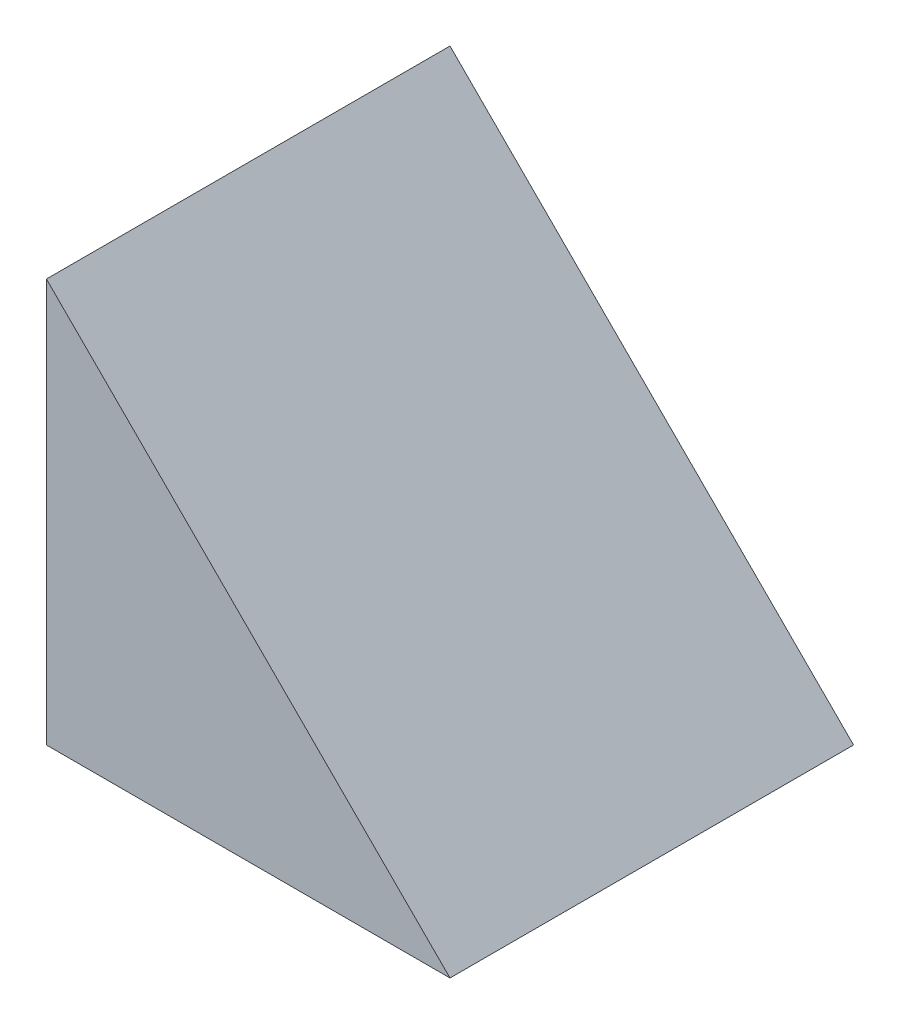
ISO-10303-21;
HEADER;
FILE_DESCRIPTION(('STEP AP214'),'2;1');
FILE_NAME('part.step','',(''),(''),'','','');
FILE_SCHEMA(('AUTOMOTIVE_DESIGN { 1 0 10303 214 1 1 1 1 }'));
ENDSEC;
DATA;
#1=APPLICATION_CONTEXT('core data for automotive mechanical design processes');
#2=APPLICATION_PROTOCOL_DEFINITION('international standard','automotive_design',2000,#1);
#3=PRODUCT_CONTEXT('',#1,'mechanical');
#4=PRODUCT('Part','Part','',(#3));
#5=PRODUCT_RELATED_PRODUCT_CATEGORY('part','',(#4));
#6=PRODUCT_DEFINITION_FORMATION('','',#4);
#7=PRODUCT_DEFINITION_CONTEXT('part definition',#1,'design');
#8=PRODUCT_DEFINITION('design','',#6,#7);
#9=PRODUCT_DEFINITION_SHAPE('','',#8);
#10=(LENGTH_UNIT() NAMED_UNIT(*) SI_UNIT(.MILLI.,.METRE.));
#11=(NAMED_UNIT(*) PLANE_ANGLE_UNIT() SI_UNIT($,.RADIAN.));
#12=(NAMED_UNIT(*) SI_UNIT($,.STERADIAN.) SOLID_ANGLE_UNIT());
#13=UNCERTAINTY_MEASURE_WITH_UNIT(LENGTH_MEASURE(1.E-05),#10,'distance_accuracy_value','');
#14=(GEOMETRIC_REPRESENTATION_CONTEXT(3) GLOBAL_UNCERTAINTY_ASSIGNED_CONTEXT((#13)) GLOBAL_UNIT_ASSIGNED_CONTEXT((#10,
#11,#12)) REPRESENTATION_CONTEXT('',''));
#15=CARTESIAN_POINT('',(0.,0.,0.));
#16=DIRECTION('',(0.,0.,1.));
#17=DIRECTION('',(1.,0.,0.));
#18=AXIS2_PLACEMENT_3D('',#15,#16,#17);
#19=CARTESIAN_POINT('',(76.2,0.,76.2));
#20=DIRECTION('',(-0.707106781186547,-0.707106781186547,0.));
#21=DIRECTION('',(0.707106781186548,-0.707106781186548,0.));
#22=AXIS2_PLACEMENT_3D('',#19,#20,#21);
#23=PLANE('',#22);
#24=DIRECTION('',(-0.707106781186547,0.707106781186547,0.));
#25=VECTOR('',#24,1.);
#26=CARTESIAN_POINT('',(76.2,0.,0.));
#27=LINE('',#26,#25);
#28=CARTESIAN_POINT('',(76.2,0.,0.));
#29=VERTEX_POINT('',#28);
#30=CARTESIAN_POINT('',(0.,76.2,0.));
#31=VERTEX_POINT('',#30);
#32=EDGE_CURVE('E80',#29,#31,#27,.T.);
#33=ORIENTED_EDGE('',*,*,#32,.T.);
#34=DIRECTION('',(0.,0.,-1.));
#35=VECTOR('',#34,1.);
#36=CARTESIAN_POINT('',(0.,76.2,76.2));
#37=LINE('',#36,#35);
#38=CARTESIAN_POINT('',(0.,76.2,76.2));
#39=VERTEX_POINT('',#38);
#40=EDGE_CURVE('E11',#39,#31,#37,.T.);
#41=ORIENTED_EDGE('',*,*,#40,.F.);
#42=DIRECTION('',(-0.707106781186547,0.707106781186547,0.));
#43=VECTOR('',#42,1.);
#44=CARTESIAN_POINT('',(76.2,0.,76.2));
#45=LINE('',#44,#43);
#46=CARTESIAN_POINT('',(76.2,0.,76.2));
#47=VERTEX_POINT('',#46);
#48=EDGE_CURVE('E73',#47,#39,#45,.T.);
#49=ORIENTED_EDGE('',*,*,#48,.F.);
#50=DIRECTION('',(0.,0.,-1.));
#51=VECTOR('',#50,1.);
#52=CARTESIAN_POINT('',(76.2,0.,76.2));
#53=LINE('',#52,#51);
#54=EDGE_CURVE('E81',#47,#29,#53,.T.);
#55=ORIENTED_EDGE('',*,*,#54,.T.);
#56=EDGE_LOOP('',(#33,#41,#49,#55));
#57=FACE_BOUND('',#56,.T.);
#58=ADVANCED_FACE('F33',(#57),#23,.F.);
#59=CARTESIAN_POINT('',(0.,76.2,76.2));
#60=DIRECTION('',(1.,0.,0.));
#61=DIRECTION('',(0.,1.,0.));
#62=AXIS2_PLACEMENT_3D('',#59,#60,#61);
#63=PLANE('',#62);
#64=DIRECTION('',(0.,-1.,0.));
#65=VECTOR('',#64,1.);
#66=CARTESIAN_POINT('',(0.,76.2,0.));
#67=LINE('',#66,#65);
#68=CARTESIAN_POINT('',(0.,0.,0.));
#69=VERTEX_POINT('',#68);
#70=EDGE_CURVE('E61',#31,#69,#67,.T.);
#71=ORIENTED_EDGE('',*,*,#70,.T.);
#72=DIRECTION('',(0.,0.,-1.));
#73=VECTOR('',#72,1.);
#74=CARTESIAN_POINT('',(0.,0.,76.2));
#75=LINE('',#74,#73);
#76=CARTESIAN_POINT('',(0.,0.,76.2));
#77=VERTEX_POINT('',#76);
#78=EDGE_CURVE('E41',#77,#69,#75,.T.);
#79=ORIENTED_EDGE('',*,*,#78,.F.);
#80=DIRECTION('',(0.,-1.,0.));
#81=VECTOR('',#80,1.);
#82=CARTESIAN_POINT('',(0.,76.2,76.2));
#83=LINE('',#82,#81);
#84=EDGE_CURVE('E69',#39,#77,#83,.T.);
#85=ORIENTED_EDGE('',*,*,#84,.F.);
#86=ORIENTED_EDGE('',*,*,#40,.T.);
#87=EDGE_LOOP('',(#71,#79,#85,#86));
#88=FACE_BOUND('',#87,.T.);
#89=ADVANCED_FACE('F70',(#88),#63,.F.);
#90=CARTESIAN_POINT('',(0.,0.,76.2));
#91=DIRECTION('',(0.,1.,0.));
#92=DIRECTION('',(0.,0.,1.));
#93=AXIS2_PLACEMENT_3D('',#90,#91,#92);
#94=PLANE('',#93);
#95=DIRECTION('',(1.,0.,0.));
#96=VECTOR('',#95,1.);
#97=CARTESIAN_POINT('',(0.,0.,0.));
#98=LINE('',#97,#96);
#99=EDGE_CURVE('E66',#69,#29,#98,.T.);
#100=ORIENTED_EDGE('',*,*,#99,.T.);
#101=ORIENTED_EDGE('',*,*,#54,.F.);
#102=DIRECTION('',(1.,0.,0.));
#103=VECTOR('',#102,1.);
#104=CARTESIAN_POINT('',(0.,0.,76.2));
#105=LINE('',#104,#103);
#106=EDGE_CURVE('E49',#77,#47,#105,.T.);
#107=ORIENTED_EDGE('',*,*,#106,.F.);
#108=ORIENTED_EDGE('',*,*,#78,.T.);
#109=EDGE_LOOP('',(#100,#101,#107,#108));
#110=FACE_BOUND('',#109,.T.);
#111=ADVANCED_FACE('F88',(#110),#94,.F.);
#112=CARTESIAN_POINT('',(0.,0.,76.2));
#113=DIRECTION('',(0.,0.,1.));
#114=DIRECTION('',(1.,0.,0.));
#115=AXIS2_PLACEMENT_3D('',#112,#113,#114);
#116=PLANE('',#115);
#117=ORIENTED_EDGE('',*,*,#48,.T.);
#118=ORIENTED_EDGE('',*,*,#84,.T.);
#119=ORIENTED_EDGE('',*,*,#106,.T.);
#120=EDGE_LOOP('',(#117,#118,#119));
#121=FACE_BOUND('',#120,.T.);
#122=ADVANCED_FACE('F76',(#121),#116,.T.);
#123=CARTESIAN_POINT('',(0.,0.,0.));
#124=DIRECTION('',(0.,0.,1.));
#125=DIRECTION('',(1.,0.,0.));
#126=AXIS2_PLACEMENT_3D('',#123,#124,#125);
#127=PLANE('',#126);
#128=ORIENTED_EDGE('',*,*,#32,.F.);
#129=ORIENTED_EDGE('',*,*,#99,.F.);
#130=ORIENTED_EDGE('',*,*,#70,.F.);
#131=EDGE_LOOP('',(#128,#129,#130));
#132=FACE_BOUND('',#131,.T.);
#133=ADVANCED_FACE('F89',(#132),#127,.F.);
#134=CLOSED_SHELL('',(#58,#89,#111,#122,#133));
#135=MANIFOLD_SOLID_BREP('B2',#134);
#136=ADVANCED_BREP_SHAPE_REPRESENTATION('',(#18,#135),#14);
#137=SHAPE_DEFINITION_REPRESENTATION(#9,#136);
ENDSEC;
END-ISO-10303-21;
